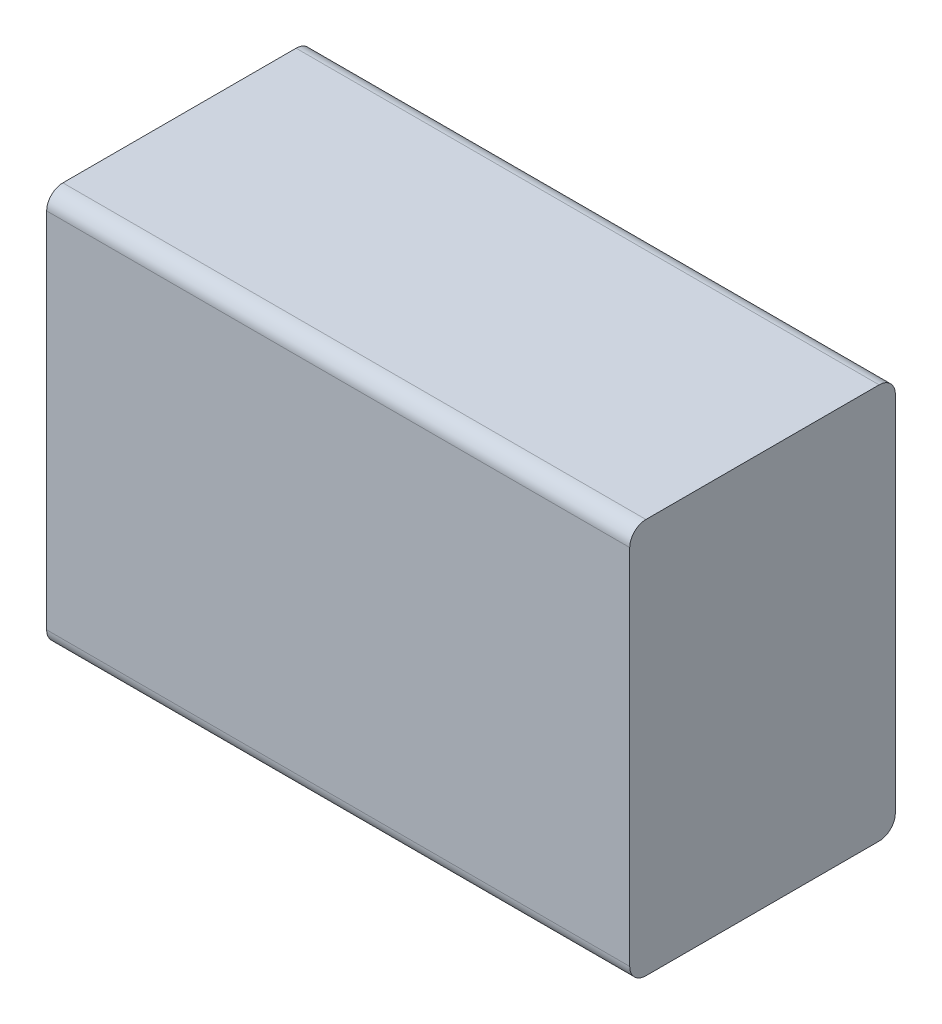
ISO-10303-21;
HEADER;
FILE_DESCRIPTION(('STEP AP214'),'2;1');
FILE_NAME('part.step','',(''),(''),'','','');
FILE_SCHEMA(('AUTOMOTIVE_DESIGN { 1 0 10303 214 1 1 1 1 }'));
ENDSEC;
DATA;
#1=APPLICATION_CONTEXT('core data for automotive mechanical design processes');
#2=APPLICATION_PROTOCOL_DEFINITION('international standard','automotive_design',2000,#1);
#3=PRODUCT_CONTEXT('',#1,'mechanical');
#4=PRODUCT('Part','Part','',(#3));
#5=PRODUCT_RELATED_PRODUCT_CATEGORY('part','',(#4));
#6=PRODUCT_DEFINITION_FORMATION('','',#4);
#7=PRODUCT_DEFINITION_CONTEXT('part definition',#1,'design');
#8=PRODUCT_DEFINITION('design','',#6,#7);
#9=PRODUCT_DEFINITION_SHAPE('','',#8);
#10=(LENGTH_UNIT() NAMED_UNIT(*) SI_UNIT(.MILLI.,.METRE.));
#11=(NAMED_UNIT(*) PLANE_ANGLE_UNIT() SI_UNIT($,.RADIAN.));
#12=(NAMED_UNIT(*) SI_UNIT($,.STERADIAN.) SOLID_ANGLE_UNIT());
#13=UNCERTAINTY_MEASURE_WITH_UNIT(LENGTH_MEASURE(1.E-05),#10,'distance_accuracy_value','');
#14=(GEOMETRIC_REPRESENTATION_CONTEXT(3) GLOBAL_UNCERTAINTY_ASSIGNED_CONTEXT((#13)) GLOBAL_UNIT_ASSIGNED_CONTEXT((#10,
#11,#12)) REPRESENTATION_CONTEXT('',''));
#15=CARTESIAN_POINT('',(0.,0.,0.));
#16=DIRECTION('',(0.,0.,1.));
#17=DIRECTION('',(1.,0.,0.));
#18=AXIS2_PLACEMENT_3D('',#15,#16,#17);
#19=CARTESIAN_POINT('',(-0.9,-0.61,0.425));
#20=DIRECTION('',(1.,0.,0.));
#21=DIRECTION('',(0.,1.,0.));
#22=AXIS2_PLACEMENT_3D('',#19,#20,#21);
#23=PLANE('',#22);
#24=DIRECTION('',(0.,0.,-1.));
#25=VECTOR('',#24,1.);
#26=CARTESIAN_POINT('',(-0.9,0.61,0.425));
#27=LINE('',#26,#25);
#28=CARTESIAN_POINT('',(-0.9,0.61,0.785));
#29=VERTEX_POINT('',#28);
#30=CARTESIAN_POINT('',(-0.9,0.61,0.065));
#31=VERTEX_POINT('',#30);
#32=EDGE_CURVE('E42',#29,#31,#27,.T.);
#33=ORIENTED_EDGE('',*,*,#32,.T.);
#34=CARTESIAN_POINT('',(-0.9,0.56,0.065));
#35=DIRECTION('',(-1.,0.,0.));
#36=DIRECTION('',(0.,0.,-1.));
#37=AXIS2_PLACEMENT_3D('',#34,#35,#36);
#38=CIRCLE('',#37,0.05);
#39=CARTESIAN_POINT('',(-0.9,0.56,0.015));
#40=VERTEX_POINT('',#39);
#41=EDGE_CURVE('E128',#31,#40,#38,.T.);
#42=ORIENTED_EDGE('',*,*,#41,.T.);
#43=DIRECTION('',(0.,1.,0.));
#44=VECTOR('',#43,1.);
#45=CARTESIAN_POINT('',(-0.9,-0.61,0.015));
#46=LINE('',#45,#44);
#47=CARTESIAN_POINT('',(-0.9,-0.56,0.015));
#48=VERTEX_POINT('',#47);
#49=EDGE_CURVE('E28',#48,#40,#46,.T.);
#50=ORIENTED_EDGE('',*,*,#49,.F.);
#51=CARTESIAN_POINT('',(-0.9,-0.56,0.065));
#52=DIRECTION('',(-1.,0.,0.));
#53=DIRECTION('',(0.,0.,-1.));
#54=AXIS2_PLACEMENT_3D('',#51,#52,#53);
#55=CIRCLE('',#54,0.05);
#56=CARTESIAN_POINT('',(-0.9,-0.61,0.065));
#57=VERTEX_POINT('',#56);
#58=EDGE_CURVE('E152',#48,#57,#55,.T.);
#59=ORIENTED_EDGE('',*,*,#58,.T.);
#60=DIRECTION('',(0.,0.,-1.));
#61=VECTOR('',#60,1.);
#62=CARTESIAN_POINT('',(-0.9,-0.61,0.425));
#63=LINE('',#62,#61);
#64=CARTESIAN_POINT('',(-0.9,-0.61,0.785));
#65=VERTEX_POINT('',#64);
#66=EDGE_CURVE('E161',#65,#57,#63,.T.);
#67=ORIENTED_EDGE('',*,*,#66,.F.);
#68=CARTESIAN_POINT('',(-0.9,-0.56,0.785));
#69=DIRECTION('',(-1.,0.,0.));
#70=DIRECTION('',(0.,0.,-1.));
#71=AXIS2_PLACEMENT_3D('',#68,#69,#70);
#72=CIRCLE('',#71,0.05);
#73=CARTESIAN_POINT('',(-0.9,-0.56,0.835));
#74=VERTEX_POINT('',#73);
#75=EDGE_CURVE('E146',#65,#74,#72,.T.);
#76=ORIENTED_EDGE('',*,*,#75,.T.);
#77=DIRECTION('',(0.,1.,0.));
#78=VECTOR('',#77,1.);
#79=CARTESIAN_POINT('',(-0.9,-0.61,0.835));
#80=LINE('',#79,#78);
#81=CARTESIAN_POINT('',(-0.9,0.56,0.835));
#82=VERTEX_POINT('',#81);
#83=EDGE_CURVE('E75',#74,#82,#80,.T.);
#84=ORIENTED_EDGE('',*,*,#83,.T.);
#85=CARTESIAN_POINT('',(-0.9,0.56,0.785));
#86=DIRECTION('',(-1.,0.,0.));
#87=DIRECTION('',(0.,0.,-1.));
#88=AXIS2_PLACEMENT_3D('',#85,#86,#87);
#89=CIRCLE('',#88,0.05);
#90=EDGE_CURVE('E140',#82,#29,#89,.T.);
#91=ORIENTED_EDGE('',*,*,#90,.T.);
#92=EDGE_LOOP('',(#33,#42,#50,#59,#67,#76,#84,#91));
#93=FACE_BOUND('',#92,.T.);
#94=ADVANCED_FACE('F17',(#93),#23,.F.);
#95=CARTESIAN_POINT('',(0.9,-0.61,0.425));
#96=DIRECTION('',(1.,0.,0.));
#97=DIRECTION('',(0.,1.,0.));
#98=AXIS2_PLACEMENT_3D('',#95,#96,#97);
#99=PLANE('',#98);
#100=DIRECTION('',(0.,1.,0.));
#101=VECTOR('',#100,1.);
#102=CARTESIAN_POINT('',(0.9,-0.61,0.015));
#103=LINE('',#102,#101);
#104=CARTESIAN_POINT('',(0.9,-0.56,0.015));
#105=VERTEX_POINT('',#104);
#106=CARTESIAN_POINT('',(0.9,0.56,0.015));
#107=VERTEX_POINT('',#106);
#108=EDGE_CURVE('E11',#105,#107,#103,.T.);
#109=ORIENTED_EDGE('',*,*,#108,.T.);
#110=CARTESIAN_POINT('',(0.9,0.56,0.065));
#111=DIRECTION('',(1.,0.,0.));
#112=DIRECTION('',(0.,0.,-1.));
#113=AXIS2_PLACEMENT_3D('',#110,#111,#112);
#114=CIRCLE('',#113,0.05);
#115=CARTESIAN_POINT('',(0.9,0.61,0.065));
#116=VERTEX_POINT('',#115);
#117=EDGE_CURVE('E115',#107,#116,#114,.T.);
#118=ORIENTED_EDGE('',*,*,#117,.T.);
#119=DIRECTION('',(0.,0.,-1.));
#120=VECTOR('',#119,1.);
#121=CARTESIAN_POINT('',(0.9,0.61,0.425));
#122=LINE('',#121,#120);
#123=CARTESIAN_POINT('',(0.9,0.61,0.785));
#124=VERTEX_POINT('',#123);
#125=EDGE_CURVE('E164',#124,#116,#122,.T.);
#126=ORIENTED_EDGE('',*,*,#125,.F.);
#127=CARTESIAN_POINT('',(0.9,0.56,0.785));
#128=DIRECTION('',(1.,0.,0.));
#129=DIRECTION('',(0.,0.,-1.));
#130=AXIS2_PLACEMENT_3D('',#127,#128,#129);
#131=CIRCLE('',#130,0.05);
#132=CARTESIAN_POINT('',(0.9,0.56,0.835));
#133=VERTEX_POINT('',#132);
#134=EDGE_CURVE('E153',#124,#133,#131,.T.);
#135=ORIENTED_EDGE('',*,*,#134,.T.);
#136=DIRECTION('',(0.,1.,0.));
#137=VECTOR('',#136,1.);
#138=CARTESIAN_POINT('',(0.9,-0.61,0.835));
#139=LINE('',#138,#137);
#140=CARTESIAN_POINT('',(0.9,-0.56,0.835));
#141=VERTEX_POINT('',#140);
#142=EDGE_CURVE('E21',#141,#133,#139,.T.);
#143=ORIENTED_EDGE('',*,*,#142,.F.);
#144=CARTESIAN_POINT('',(0.9,-0.56,0.785));
#145=DIRECTION('',(1.,0.,0.));
#146=DIRECTION('',(0.,0.,-1.));
#147=AXIS2_PLACEMENT_3D('',#144,#145,#146);
#148=CIRCLE('',#147,0.05);
#149=CARTESIAN_POINT('',(0.9,-0.61,0.785));
#150=VERTEX_POINT('',#149);
#151=EDGE_CURVE('E171',#141,#150,#148,.T.);
#152=ORIENTED_EDGE('',*,*,#151,.T.);
#153=DIRECTION('',(0.,0.,-1.));
#154=VECTOR('',#153,1.);
#155=CARTESIAN_POINT('',(0.9,-0.61,0.425));
#156=LINE('',#155,#154);
#157=CARTESIAN_POINT('',(0.9,-0.61,0.065));
#158=VERTEX_POINT('',#157);
#159=EDGE_CURVE('E88',#150,#158,#156,.T.);
#160=ORIENTED_EDGE('',*,*,#159,.T.);
#161=CARTESIAN_POINT('',(0.9,-0.56,0.065));
#162=DIRECTION('',(1.,0.,0.));
#163=DIRECTION('',(0.,0.,-1.));
#164=AXIS2_PLACEMENT_3D('',#161,#162,#163);
#165=CIRCLE('',#164,0.05);
#166=EDGE_CURVE('E117',#158,#105,#165,.T.);
#167=ORIENTED_EDGE('',*,*,#166,.T.);
#168=EDGE_LOOP('',(#109,#118,#126,#135,#143,#152,#160,#167));
#169=FACE_BOUND('',#168,.T.);
#170=ADVANCED_FACE('F113',(#169),#99,.T.);
#171=CARTESIAN_POINT('',(0.,-0.61,0.015));
#172=DIRECTION('',(0.,0.,-1.));
#173=DIRECTION('',(0.,-1.,0.));
#174=AXIS2_PLACEMENT_3D('',#171,#172,#173);
#175=PLANE('',#174);
#176=ORIENTED_EDGE('',*,*,#49,.T.);
#177=DIRECTION('',(1.,0.,0.));
#178=VECTOR('',#177,1.);
#179=CARTESIAN_POINT('',(0.,0.56,0.015));
#180=LINE('',#179,#178);
#181=EDGE_CURVE('E122',#40,#107,#180,.T.);
#182=ORIENTED_EDGE('',*,*,#181,.T.);
#183=ORIENTED_EDGE('',*,*,#108,.F.);
#184=DIRECTION('',(-1.,0.,0.));
#185=VECTOR('',#184,1.);
#186=CARTESIAN_POINT('',(0.,-0.56,0.015));
#187=LINE('',#186,#185);
#188=EDGE_CURVE('E158',#105,#48,#187,.T.);
#189=ORIENTED_EDGE('',*,*,#188,.T.);
#190=EDGE_LOOP('',(#176,#182,#183,#189));
#191=FACE_BOUND('',#190,.T.);
#192=ADVANCED_FACE('F123',(#191),#175,.T.);
#193=CARTESIAN_POINT('',(0.,-0.61,0.835));
#194=DIRECTION('',(0.,0.,-1.));
#195=DIRECTION('',(0.,-1.,0.));
#196=AXIS2_PLACEMENT_3D('',#193,#194,#195);
#197=PLANE('',#196);
#198=ORIENTED_EDGE('',*,*,#142,.T.);
#199=DIRECTION('',(-1.,0.,0.));
#200=VECTOR('',#199,1.);
#201=CARTESIAN_POINT('',(-0.9,0.56,0.835));
#202=LINE('',#201,#200);
#203=EDGE_CURVE('E134',#133,#82,#202,.T.);
#204=ORIENTED_EDGE('',*,*,#203,.T.);
#205=ORIENTED_EDGE('',*,*,#83,.F.);
#206=DIRECTION('',(1.,0.,0.));
#207=VECTOR('',#206,1.);
#208=CARTESIAN_POINT('',(0.9,-0.56,0.835));
#209=LINE('',#208,#207);
#210=EDGE_CURVE('E175',#74,#141,#209,.T.);
#211=ORIENTED_EDGE('',*,*,#210,.T.);
#212=EDGE_LOOP('',(#198,#204,#205,#211));
#213=FACE_BOUND('',#212,.T.);
#214=ADVANCED_FACE('F184',(#213),#197,.F.);
#215=CARTESIAN_POINT('',(0.,0.61,0.425));
#216=DIRECTION('',(0.,1.,0.));
#217=DIRECTION('',(1.,0.,0.));
#218=AXIS2_PLACEMENT_3D('',#215,#216,#217);
#219=PLANE('',#218);
#220=ORIENTED_EDGE('',*,*,#125,.T.);
#221=DIRECTION('',(-1.,0.,0.));
#222=VECTOR('',#221,1.);
#223=CARTESIAN_POINT('',(0.,0.61,0.065));
#224=LINE('',#223,#222);
#225=EDGE_CURVE('E132',#116,#31,#224,.T.);
#226=ORIENTED_EDGE('',*,*,#225,.T.);
#227=ORIENTED_EDGE('',*,*,#32,.F.);
#228=DIRECTION('',(1.,0.,0.));
#229=VECTOR('',#228,1.);
#230=CARTESIAN_POINT('',(0.9,0.61,0.785));
#231=LINE('',#230,#229);
#232=EDGE_CURVE('E157',#29,#124,#231,.T.);
#233=ORIENTED_EDGE('',*,*,#232,.T.);
#234=EDGE_LOOP('',(#220,#226,#227,#233));
#235=FACE_BOUND('',#234,.T.);
#236=ADVANCED_FACE('F217',(#235),#219,.T.);
#237=CARTESIAN_POINT('',(0.,-0.61,0.425));
#238=DIRECTION('',(0.,-1.,0.));
#239=DIRECTION('',(0.,0.,-1.));
#240=AXIS2_PLACEMENT_3D('',#237,#238,#239);
#241=PLANE('',#240);
#242=ORIENTED_EDGE('',*,*,#159,.F.);
#243=DIRECTION('',(-1.,0.,0.));
#244=VECTOR('',#243,1.);
#245=CARTESIAN_POINT('',(-0.9,-0.61,0.785));
#246=LINE('',#245,#244);
#247=EDGE_CURVE('E144',#150,#65,#246,.T.);
#248=ORIENTED_EDGE('',*,*,#247,.T.);
#249=ORIENTED_EDGE('',*,*,#66,.T.);
#250=DIRECTION('',(1.,0.,0.));
#251=VECTOR('',#250,1.);
#252=CARTESIAN_POINT('',(0.,-0.61,0.065));
#253=LINE('',#252,#251);
#254=EDGE_CURVE('E149',#57,#158,#253,.T.);
#255=ORIENTED_EDGE('',*,*,#254,.T.);
#256=EDGE_LOOP('',(#242,#248,#249,#255));
#257=FACE_BOUND('',#256,.T.);
#258=ADVANCED_FACE('F215',(#257),#241,.T.);
#259=CARTESIAN_POINT('',(0.,0.56,0.065));
#260=DIRECTION('',(1.,0.,0.));
#261=DIRECTION('',(0.,0.,1.));
#262=AXIS2_PLACEMENT_3D('',#259,#260,#261);
#263=CYLINDRICAL_SURFACE('',#262,0.05);
#264=ORIENTED_EDGE('',*,*,#117,.F.);
#265=ORIENTED_EDGE('',*,*,#181,.F.);
#266=ORIENTED_EDGE('',*,*,#41,.F.);
#267=ORIENTED_EDGE('',*,*,#225,.F.);
#268=EDGE_LOOP('',(#264,#265,#266,#267));
#269=FACE_BOUND('',#268,.T.);
#270=ADVANCED_FACE('F131',(#269),#263,.T.);
#271=CARTESIAN_POINT('',(0.,0.56,0.785));
#272=DIRECTION('',(-1.,0.,0.));
#273=DIRECTION('',(0.,0.,-1.));
#274=AXIS2_PLACEMENT_3D('',#271,#272,#273);
#275=CYLINDRICAL_SURFACE('',#274,0.05);
#276=ORIENTED_EDGE('',*,*,#134,.F.);
#277=ORIENTED_EDGE('',*,*,#232,.F.);
#278=ORIENTED_EDGE('',*,*,#90,.F.);
#279=ORIENTED_EDGE('',*,*,#203,.F.);
#280=EDGE_LOOP('',(#276,#277,#278,#279));
#281=FACE_BOUND('',#280,.T.);
#282=ADVANCED_FACE('F224',(#281),#275,.T.);
#283=CARTESIAN_POINT('',(0.,-0.56,0.065));
#284=DIRECTION('',(1.,0.,0.));
#285=DIRECTION('',(0.,0.,1.));
#286=AXIS2_PLACEMENT_3D('',#283,#284,#285);
#287=CYLINDRICAL_SURFACE('',#286,0.05);
#288=ORIENTED_EDGE('',*,*,#166,.F.);
#289=ORIENTED_EDGE('',*,*,#254,.F.);
#290=ORIENTED_EDGE('',*,*,#58,.F.);
#291=ORIENTED_EDGE('',*,*,#188,.F.);
#292=EDGE_LOOP('',(#288,#289,#290,#291));
#293=FACE_BOUND('',#292,.T.);
#294=ADVANCED_FACE('F214',(#293),#287,.T.);
#295=CARTESIAN_POINT('',(0.,-0.56,0.785));
#296=DIRECTION('',(-1.,0.,0.));
#297=DIRECTION('',(0.,0.,-1.));
#298=AXIS2_PLACEMENT_3D('',#295,#296,#297);
#299=CYLINDRICAL_SURFACE('',#298,0.05);
#300=ORIENTED_EDGE('',*,*,#151,.F.);
#301=ORIENTED_EDGE('',*,*,#210,.F.);
#302=ORIENTED_EDGE('',*,*,#75,.F.);
#303=ORIENTED_EDGE('',*,*,#247,.F.);
#304=EDGE_LOOP('',(#300,#301,#302,#303));
#305=FACE_BOUND('',#304,.T.);
#306=ADVANCED_FACE('F19',(#305),#299,.T.);
#307=CLOSED_SHELL('',(#94,#170,#192,#214,#236,#258,#270,#282,#294,#306));
#308=MANIFOLD_SOLID_BREP('B1',#307);
#309=ADVANCED_BREP_SHAPE_REPRESENTATION('',(#18,#308),#14);
#310=SHAPE_DEFINITION_REPRESENTATION(#9,#309);
ENDSEC;
END-ISO-10303-21;
